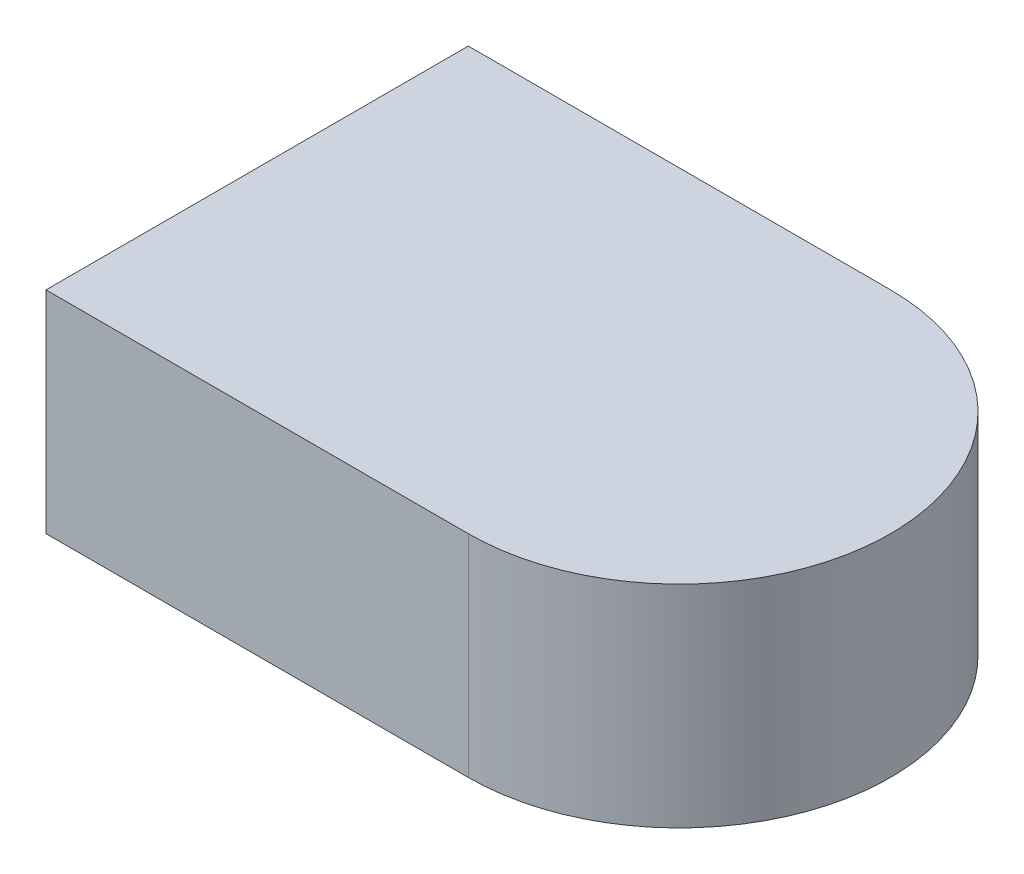
ISO-10303-21;
HEADER;
FILE_DESCRIPTION(('STEP AP214'),'2;1');
FILE_NAME('part.step','',(''),(''),'','','');
FILE_SCHEMA(('AUTOMOTIVE_DESIGN { 1 0 10303 214 1 1 1 1 }'));
ENDSEC;
DATA;
#1=APPLICATION_CONTEXT('core data for automotive mechanical design processes');
#2=APPLICATION_PROTOCOL_DEFINITION('international standard','automotive_design',2000,#1);
#3=PRODUCT_CONTEXT('',#1,'mechanical');
#4=PRODUCT('Part','Part','',(#3));
#5=PRODUCT_RELATED_PRODUCT_CATEGORY('part','',(#4));
#6=PRODUCT_DEFINITION_FORMATION('','',#4);
#7=PRODUCT_DEFINITION_CONTEXT('part definition',#1,'design');
#8=PRODUCT_DEFINITION('design','',#6,#7);
#9=PRODUCT_DEFINITION_SHAPE('','',#8);
#10=(LENGTH_UNIT() NAMED_UNIT(*) SI_UNIT(.MILLI.,.METRE.));
#11=(NAMED_UNIT(*) PLANE_ANGLE_UNIT() SI_UNIT($,.RADIAN.));
#12=(NAMED_UNIT(*) SI_UNIT($,.STERADIAN.) SOLID_ANGLE_UNIT());
#13=UNCERTAINTY_MEASURE_WITH_UNIT(LENGTH_MEASURE(1.E-05),#10,'distance_accuracy_value','');
#14=(GEOMETRIC_REPRESENTATION_CONTEXT(3) GLOBAL_UNCERTAINTY_ASSIGNED_CONTEXT((#13)) GLOBAL_UNIT_ASSIGNED_CONTEXT((#10,
#11,#12)) REPRESENTATION_CONTEXT('',''));
#15=CARTESIAN_POINT('',(0.,0.,0.));
#16=DIRECTION('',(0.,0.,1.));
#17=DIRECTION('',(1.,0.,0.));
#18=AXIS2_PLACEMENT_3D('',#15,#16,#17);
#19=CARTESIAN_POINT('',(0.,0.,0.));
#20=DIRECTION('',(0.,-1.,0.));
#21=DIRECTION('',(-1.,0.,0.));
#22=AXIS2_PLACEMENT_3D('',#19,#20,#21);
#23=PLANE('',#22);
#24=CARTESIAN_POINT('',(-1.05,0.,-1.4));
#25=DIRECTION('',(0.,-1.,0.));
#26=DIRECTION('',(0.,0.,-1.));
#27=AXIS2_PLACEMENT_3D('',#24,#25,#26);
#28=CIRCLE('',#27,0.1);
#29=CARTESIAN_POINT('',(-1.05,0.,-1.5));
#30=VERTEX_POINT('',#29);
#31=CARTESIAN_POINT('',(-1.05,0.,-1.3));
#32=VERTEX_POINT('',#31);
#33=EDGE_CURVE('E11',#30,#32,#28,.T.);
#34=ORIENTED_EDGE('',*,*,#33,.T.);
#35=DIRECTION('',(-1.,0.,0.));
#36=VECTOR('',#35,1.);
#37=CARTESIAN_POINT('',(-1.05,0.,-1.3));
#38=LINE('',#37,#36);
#39=CARTESIAN_POINT('',(-1.25,0.,-1.3));
#40=VERTEX_POINT('',#39);
#41=EDGE_CURVE('E25',#32,#40,#38,.T.);
#42=ORIENTED_EDGE('',*,*,#41,.T.);
#43=DIRECTION('',(0.,0.,-1.));
#44=VECTOR('',#43,1.);
#45=CARTESIAN_POINT('',(-1.25,0.,-1.3));
#46=LINE('',#45,#44);
#47=CARTESIAN_POINT('',(-1.25,0.,-1.5));
#48=VERTEX_POINT('',#47);
#49=EDGE_CURVE('E73',#40,#48,#46,.T.);
#50=ORIENTED_EDGE('',*,*,#49,.T.);
#51=DIRECTION('',(1.,0.,0.));
#52=VECTOR('',#51,1.);
#53=CARTESIAN_POINT('',(-1.25,0.,-1.5));
#54=LINE('',#53,#52);
#55=EDGE_CURVE('E99',#48,#30,#54,.T.);
#56=ORIENTED_EDGE('',*,*,#55,.T.);
#57=EDGE_LOOP('',(#34,#42,#50,#56));
#58=FACE_BOUND('',#57,.T.);
#59=ADVANCED_FACE('F17',(#58),#23,.T.);
#60=CARTESIAN_POINT('',(-1.25,0.,-1.5));
#61=DIRECTION('',(0.,0.,1.));
#62=DIRECTION('',(1.,0.,0.));
#63=AXIS2_PLACEMENT_3D('',#60,#61,#62);
#64=PLANE('',#63);
#65=DIRECTION('',(0.,1.,0.));
#66=VECTOR('',#65,1.);
#67=CARTESIAN_POINT('',(-1.25,0.,-1.5));
#68=LINE('',#67,#66);
#69=CARTESIAN_POINT('',(-1.25,0.1,-1.5));
#70=VERTEX_POINT('',#69);
#71=EDGE_CURVE('E95',#48,#70,#68,.T.);
#72=ORIENTED_EDGE('',*,*,#71,.T.);
#73=DIRECTION('',(1.,0.,0.));
#74=VECTOR('',#73,1.);
#75=CARTESIAN_POINT('',(-1.25,0.1,-1.5));
#76=LINE('',#75,#74);
#77=CARTESIAN_POINT('',(-1.05,0.1,-1.5));
#78=VERTEX_POINT('',#77);
#79=EDGE_CURVE('E68',#70,#78,#76,.T.);
#80=ORIENTED_EDGE('',*,*,#79,.T.);
#81=DIRECTION('',(0.,1.,0.));
#82=VECTOR('',#81,1.);
#83=CARTESIAN_POINT('',(-1.05,0.,-1.5));
#84=LINE('',#83,#82);
#85=EDGE_CURVE('E87',#30,#78,#84,.T.);
#86=ORIENTED_EDGE('',*,*,#85,.F.);
#87=ORIENTED_EDGE('',*,*,#55,.F.);
#88=EDGE_LOOP('',(#72,#80,#86,#87));
#89=FACE_BOUND('',#88,.T.);
#90=ADVANCED_FACE('F113',(#89),#64,.F.);
#91=CARTESIAN_POINT('',(-1.05,0.,-1.4));
#92=DIRECTION('',(0.,-1.,0.));
#93=DIRECTION('',(-1.,0.,0.));
#94=AXIS2_PLACEMENT_3D('',#91,#92,#93);
#95=CYLINDRICAL_SURFACE('',#94,0.1);
#96=ORIENTED_EDGE('',*,*,#85,.T.);
#97=CARTESIAN_POINT('',(-1.05,0.1,-1.4));
#98=DIRECTION('',(0.,-1.,0.));
#99=DIRECTION('',(0.,0.,-1.));
#100=AXIS2_PLACEMENT_3D('',#97,#98,#99);
#101=CIRCLE('',#100,0.1);
#102=CARTESIAN_POINT('',(-1.05,0.1,-1.3));
#103=VERTEX_POINT('',#102);
#104=EDGE_CURVE('E83',#78,#103,#101,.T.);
#105=ORIENTED_EDGE('',*,*,#104,.T.);
#106=DIRECTION('',(0.,1.,0.));
#107=VECTOR('',#106,1.);
#108=CARTESIAN_POINT('',(-1.05,0.,-1.3));
#109=LINE('',#108,#107);
#110=EDGE_CURVE('E60',#32,#103,#109,.T.);
#111=ORIENTED_EDGE('',*,*,#110,.F.);
#112=ORIENTED_EDGE('',*,*,#33,.F.);
#113=EDGE_LOOP('',(#96,#105,#111,#112));
#114=FACE_BOUND('',#113,.T.);
#115=ADVANCED_FACE('F115',(#114),#95,.T.);
#116=CARTESIAN_POINT('',(-1.05,0.,-1.3));
#117=DIRECTION('',(0.,0.,-1.));
#118=DIRECTION('',(-1.,0.,0.));
#119=AXIS2_PLACEMENT_3D('',#116,#117,#118);
#120=PLANE('',#119);
#121=ORIENTED_EDGE('',*,*,#110,.T.);
#122=DIRECTION('',(-1.,0.,0.));
#123=VECTOR('',#122,1.);
#124=CARTESIAN_POINT('',(-1.05,0.1,-1.3));
#125=LINE('',#124,#123);
#126=CARTESIAN_POINT('',(-1.25,0.1,-1.3));
#127=VERTEX_POINT('',#126);
#128=EDGE_CURVE('E53',#103,#127,#125,.T.);
#129=ORIENTED_EDGE('',*,*,#128,.T.);
#130=DIRECTION('',(0.,1.,0.));
#131=VECTOR('',#130,1.);
#132=CARTESIAN_POINT('',(-1.25,0.,-1.3));
#133=LINE('',#132,#131);
#134=EDGE_CURVE('E57',#40,#127,#133,.T.);
#135=ORIENTED_EDGE('',*,*,#134,.F.);
#136=ORIENTED_EDGE('',*,*,#41,.F.);
#137=EDGE_LOOP('',(#121,#129,#135,#136));
#138=FACE_BOUND('',#137,.T.);
#139=ADVANCED_FACE('F55',(#138),#120,.F.);
#140=CARTESIAN_POINT('',(-1.25,0.,-1.3));
#141=DIRECTION('',(1.,0.,0.));
#142=DIRECTION('',(0.,0.,-1.));
#143=AXIS2_PLACEMENT_3D('',#140,#141,#142);
#144=PLANE('',#143);
#145=ORIENTED_EDGE('',*,*,#134,.T.);
#146=DIRECTION('',(0.,0.,-1.));
#147=VECTOR('',#146,1.);
#148=CARTESIAN_POINT('',(-1.25,0.1,-1.3));
#149=LINE('',#148,#147);
#150=EDGE_CURVE('E66',#127,#70,#149,.T.);
#151=ORIENTED_EDGE('',*,*,#150,.T.);
#152=ORIENTED_EDGE('',*,*,#71,.F.);
#153=ORIENTED_EDGE('',*,*,#49,.F.);
#154=EDGE_LOOP('',(#145,#151,#152,#153));
#155=FACE_BOUND('',#154,.T.);
#156=ADVANCED_FACE('F72',(#155),#144,.F.);
#157=CARTESIAN_POINT('',(0.,0.1,0.));
#158=DIRECTION('',(0.,-1.,0.));
#159=DIRECTION('',(-1.,0.,0.));
#160=AXIS2_PLACEMENT_3D('',#157,#158,#159);
#161=PLANE('',#160);
#162=ORIENTED_EDGE('',*,*,#150,.F.);
#163=ORIENTED_EDGE('',*,*,#128,.F.);
#164=ORIENTED_EDGE('',*,*,#104,.F.);
#165=ORIENTED_EDGE('',*,*,#79,.F.);
#166=EDGE_LOOP('',(#162,#163,#164,#165));
#167=FACE_BOUND('',#166,.T.);
#168=ADVANCED_FACE('F67',(#167),#161,.F.);
#169=CLOSED_SHELL('',(#59,#90,#115,#139,#156,#168));
#170=MANIFOLD_SOLID_BREP('B1',#169);
#171=ADVANCED_BREP_SHAPE_REPRESENTATION('',(#18,#170),#14);
#172=SHAPE_DEFINITION_REPRESENTATION(#9,#171);
ENDSEC;
END-ISO-10303-21;
